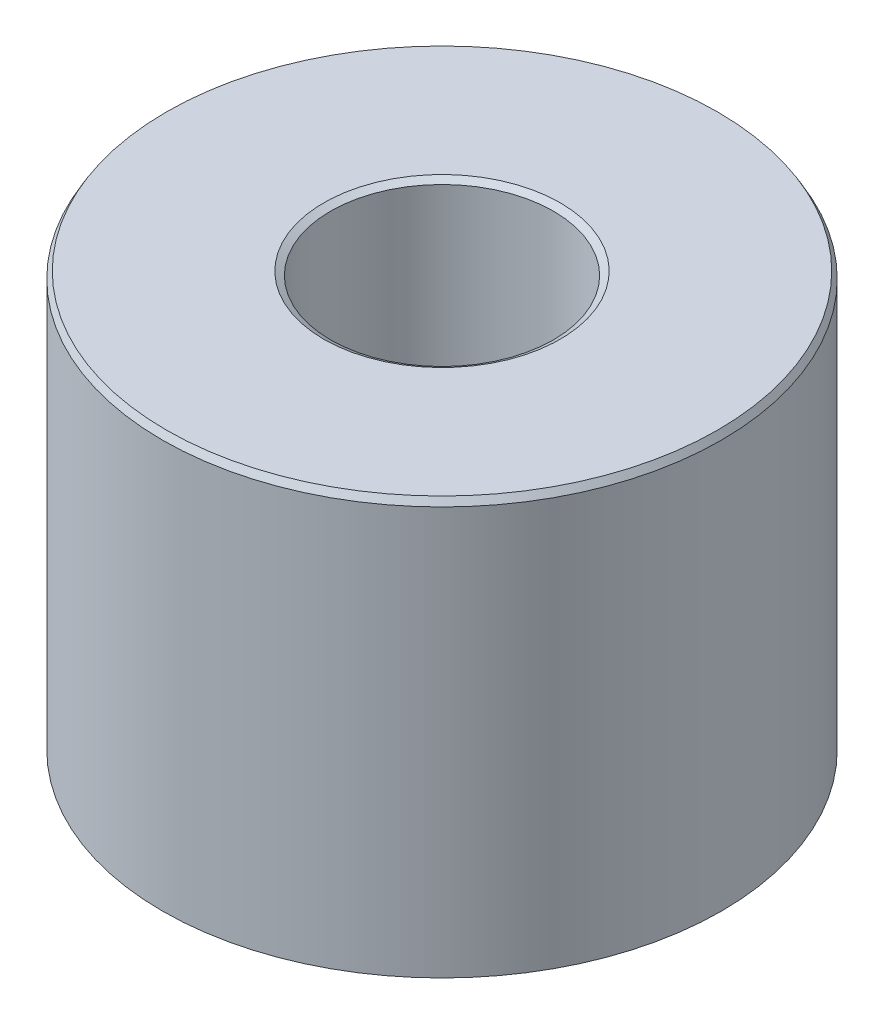
ISO-10303-21;
HEADER;
FILE_DESCRIPTION(('STEP AP214'),'2;1');
FILE_NAME('part.step','',(''),(''),'','','');
FILE_SCHEMA(('AUTOMOTIVE_DESIGN { 1 0 10303 214 1 1 1 1 }'));
ENDSEC;
DATA;
#1=APPLICATION_CONTEXT('core data for automotive mechanical design processes');
#2=APPLICATION_PROTOCOL_DEFINITION('international standard','automotive_design',2000,#1);
#3=PRODUCT_CONTEXT('',#1,'mechanical');
#4=PRODUCT('Part','Part','',(#3));
#5=PRODUCT_RELATED_PRODUCT_CATEGORY('part','',(#4));
#6=PRODUCT_DEFINITION_FORMATION('','',#4);
#7=PRODUCT_DEFINITION_CONTEXT('part definition',#1,'design');
#8=PRODUCT_DEFINITION('design','',#6,#7);
#9=PRODUCT_DEFINITION_SHAPE('','',#8);
#10=(LENGTH_UNIT() NAMED_UNIT(*) SI_UNIT(.MILLI.,.METRE.));
#11=(NAMED_UNIT(*) PLANE_ANGLE_UNIT() SI_UNIT($,.RADIAN.));
#12=(NAMED_UNIT(*) SI_UNIT($,.STERADIAN.) SOLID_ANGLE_UNIT());
#13=UNCERTAINTY_MEASURE_WITH_UNIT(LENGTH_MEASURE(1.E-05),#10,'distance_accuracy_value','');
#14=(GEOMETRIC_REPRESENTATION_CONTEXT(3) GLOBAL_UNCERTAINTY_ASSIGNED_CONTEXT((#13)) GLOBAL_UNIT_ASSIGNED_CONTEXT((#10,
#11,#12)) REPRESENTATION_CONTEXT('',''));
#15=CARTESIAN_POINT('',(0.,0.,0.));
#16=DIRECTION('',(0.,0.,1.));
#17=DIRECTION('',(1.,0.,0.));
#18=AXIS2_PLACEMENT_3D('',#15,#16,#17);
#19=CARTESIAN_POINT('',(0.,37.439071314002,0.));
#20=DIRECTION('',(0.,-1.,0.));
#21=DIRECTION('',(0.,0.,-1.));
#22=AXIS2_PLACEMENT_3D('',#19,#20,#21);
#23=CYLINDRICAL_SURFACE('',#22,25.);
#24=CARTESIAN_POINT('',(0.,0.347795770721269,0.));
#25=DIRECTION('',(0.,1.,0.));
#26=DIRECTION('',(0.,0.,1.));
#27=AXIS2_PLACEMENT_3D('',#24,#25,#26);
#28=CIRCLE('',#27,25.);
#29=CARTESIAN_POINT('',(0.,0.347795770721269,25.));
#30=VERTEX_POINT('',#29);
#31=EDGE_CURVE('E10',#30,#30,#28,.T.);
#32=ORIENTED_EDGE('',*,*,#31,.T.);
#33=EDGE_LOOP('',(#32));
#34=FACE_BOUND('',#33,.T.);
#35=CARTESIAN_POINT('',(0.,36.8366713684552,0.));
#36=DIRECTION('',(0.,1.,0.));
#37=DIRECTION('',(0.,0.,1.));
#38=AXIS2_PLACEMENT_3D('',#35,#36,#37);
#39=CIRCLE('',#38,25.);
#40=CARTESIAN_POINT('',(0.,36.8366713684552,25.));
#41=VERTEX_POINT('',#40);
#42=EDGE_CURVE('E50',#41,#41,#39,.F.);
#43=ORIENTED_EDGE('',*,*,#42,.T.);
#44=EDGE_LOOP('',(#43));
#45=FACE_BOUND('',#44,.T.);
#46=ADVANCED_FACE('F39',(#34,#45),#23,.T.);
#47=CARTESIAN_POINT('',(0.,37.439071314002,0.));
#48=DIRECTION('',(0.,1.,0.));
#49=DIRECTION('',(0.,0.,1.));
#50=AXIS2_PLACEMENT_3D('',#47,#48,#49);
#51=PLANE('',#50);
#52=CARTESIAN_POINT('',(0.,37.439071314002,0.));
#53=DIRECTION('',(0.,1.,0.));
#54=DIRECTION('',(0.,0.,1.));
#55=AXIS2_PLACEMENT_3D('',#52,#53,#54);
#56=CIRCLE('',#55,10.5751178700881);
#57=CARTESIAN_POINT('',(0.,37.439071314002,10.5751178700881));
#58=VERTEX_POINT('',#57);
#59=EDGE_CURVE('E58',#58,#58,#56,.F.);
#60=ORIENTED_EDGE('',*,*,#59,.T.);
#61=EDGE_LOOP('',(#60));
#62=FACE_BOUND('',#61,.T.);
#63=CARTESIAN_POINT('',(0.,37.439071314002,0.));
#64=DIRECTION('',(0.,1.,0.));
#65=DIRECTION('',(0.,0.,1.));
#66=AXIS2_PLACEMENT_3D('',#63,#64,#65);
#67=CIRCLE('',#66,24.6522042292787);
#68=CARTESIAN_POINT('',(0.,37.439071314002,24.6522042292787));
#69=VERTEX_POINT('',#68);
#70=EDGE_CURVE('E61',#69,#69,#67,.T.);
#71=ORIENTED_EDGE('',*,*,#70,.T.);
#72=EDGE_LOOP('',(#71));
#73=FACE_BOUND('',#72,.T.);
#74=ADVANCED_FACE('F88',(#62,#73),#51,.T.);
#75=CARTESIAN_POINT('',(0.,0.,0.));
#76=DIRECTION('',(0.,1.,0.));
#77=DIRECTION('',(0.,0.,1.));
#78=AXIS2_PLACEMENT_3D('',#75,#76,#77);
#79=PLANE('',#78);
#80=CARTESIAN_POINT('',(0.,0.,0.));
#81=DIRECTION('',(0.,1.,0.));
#82=DIRECTION('',(0.,0.,1.));
#83=AXIS2_PLACEMENT_3D('',#80,#81,#82);
#84=CIRCLE('',#83,10.3205136952625);
#85=CARTESIAN_POINT('',(0.,0.,10.3205136952625));
#86=VERTEX_POINT('',#85);
#87=EDGE_CURVE('E51',#86,#86,#84,.T.);
#88=ORIENTED_EDGE('',*,*,#87,.T.);
#89=EDGE_LOOP('',(#88));
#90=FACE_BOUND('',#89,.T.);
#91=CARTESIAN_POINT('',(0.,0.,0.));
#92=DIRECTION('',(0.,1.,0.));
#93=DIRECTION('',(0.,0.,1.));
#94=AXIS2_PLACEMENT_3D('',#91,#92,#93);
#95=CIRCLE('',#94,24.3976000544532);
#96=CARTESIAN_POINT('',(0.,0.,24.3976000544532));
#97=VERTEX_POINT('',#96);
#98=EDGE_CURVE('E54',#97,#97,#95,.F.);
#99=ORIENTED_EDGE('',*,*,#98,.T.);
#100=EDGE_LOOP('',(#99));
#101=FACE_BOUND('',#100,.T.);
#102=ADVANCED_FACE('F83',(#90,#101),#79,.F.);
#103=CARTESIAN_POINT('',(0.,37.439071314002,0.));
#104=DIRECTION('',(0.,-1.,0.));
#105=DIRECTION('',(0.,0.,-1.));
#106=AXIS2_PLACEMENT_3D('',#103,#104,#105);
#107=CYLINDRICAL_SURFACE('',#106,9.97271792454128);
#108=CARTESIAN_POINT('',(0.,37.0912755432807,0.));
#109=DIRECTION('',(0.,1.,0.));
#110=DIRECTION('',(0.,0.,1.));
#111=AXIS2_PLACEMENT_3D('',#108,#109,#110);
#112=CIRCLE('',#111,9.97271792454128);
#113=CARTESIAN_POINT('',(0.,37.0912755432807,9.97271792454128));
#114=VERTEX_POINT('',#113);
#115=EDGE_CURVE('E67',#114,#114,#112,.T.);
#116=ORIENTED_EDGE('',*,*,#115,.T.);
#117=EDGE_LOOP('',(#116));
#118=FACE_BOUND('',#117,.T.);
#119=CARTESIAN_POINT('',(0.,0.602399945546811,0.));
#120=DIRECTION('',(0.,1.,0.));
#121=DIRECTION('',(0.,0.,1.));
#122=AXIS2_PLACEMENT_3D('',#119,#120,#121);
#123=CIRCLE('',#122,9.97271792454128);
#124=CARTESIAN_POINT('',(0.,0.602399945546811,9.97271792454128));
#125=VERTEX_POINT('',#124);
#126=EDGE_CURVE('E69',#125,#125,#123,.F.);
#127=ORIENTED_EDGE('',*,*,#126,.T.);
#128=EDGE_LOOP('',(#127));
#129=FACE_BOUND('',#128,.T.);
#130=ADVANCED_FACE('F71',(#118,#129),#107,.F.);
#131=CARTESIAN_POINT('',(0.,37.0912755432807,0.));
#132=DIRECTION('',(0.,1.,0.));
#133=DIRECTION('',(0.,0.,1.));
#134=AXIS2_PLACEMENT_3D('',#131,#132,#133);
#135=CONICAL_SURFACE('',#134,9.97271792454128,1.0471975511966);
#136=ORIENTED_EDGE('',*,*,#59,.F.);
#137=EDGE_LOOP('',(#136));
#138=FACE_BOUND('',#137,.T.);
#139=ORIENTED_EDGE('',*,*,#115,.F.);
#140=EDGE_LOOP('',(#139));
#141=FACE_BOUND('',#140,.T.);
#142=ADVANCED_FACE('F77',(#138,#141),#135,.F.);
#143=CARTESIAN_POINT('',(0.,0.,0.));
#144=DIRECTION('',(0.,-1.,0.));
#145=DIRECTION('',(0.,0.,-1.));
#146=AXIS2_PLACEMENT_3D('',#143,#144,#145);
#147=CONICAL_SURFACE('',#146,10.3205136952625,0.523598775598295);
#148=ORIENTED_EDGE('',*,*,#126,.F.);
#149=EDGE_LOOP('',(#148));
#150=FACE_BOUND('',#149,.T.);
#151=ORIENTED_EDGE('',*,*,#87,.F.);
#152=EDGE_LOOP('',(#151));
#153=FACE_BOUND('',#152,.T.);
#154=ADVANCED_FACE('F73',(#150,#153),#147,.F.);
#155=CARTESIAN_POINT('',(0.,0.347795770721269,0.));
#156=DIRECTION('',(0.,1.,0.));
#157=DIRECTION('',(0.,0.,1.));
#158=AXIS2_PLACEMENT_3D('',#155,#156,#157);
#159=CONICAL_SURFACE('',#158,25.,1.0471975511966);
#160=ORIENTED_EDGE('',*,*,#98,.F.);
#161=EDGE_LOOP('',(#160));
#162=FACE_BOUND('',#161,.T.);
#163=ORIENTED_EDGE('',*,*,#31,.F.);
#164=EDGE_LOOP('',(#163));
#165=FACE_BOUND('',#164,.T.);
#166=ADVANCED_FACE('F76',(#162,#165),#159,.T.);
#167=CARTESIAN_POINT('',(0.,37.439071314002,0.));
#168=DIRECTION('',(0.,-1.,0.));
#169=DIRECTION('',(0.,0.,-1.));
#170=AXIS2_PLACEMENT_3D('',#167,#168,#169);
#171=CONICAL_SURFACE('',#170,24.6522042292787,0.523598775598283);
#172=ORIENTED_EDGE('',*,*,#42,.F.);
#173=EDGE_LOOP('',(#172));
#174=FACE_BOUND('',#173,.T.);
#175=ORIENTED_EDGE('',*,*,#70,.F.);
#176=EDGE_LOOP('',(#175));
#177=FACE_BOUND('',#176,.T.);
#178=ADVANCED_FACE('F45',(#174,#177),#171,.T.);
#179=CLOSED_SHELL('',(#46,#74,#102,#130,#142,#154,#166,#178));
#180=MANIFOLD_SOLID_BREP('B2',#179);
#181=ADVANCED_BREP_SHAPE_REPRESENTATION('',(#18,#180),#14);
#182=SHAPE_DEFINITION_REPRESENTATION(#9,#181);
ENDSEC;
END-ISO-10303-21;
